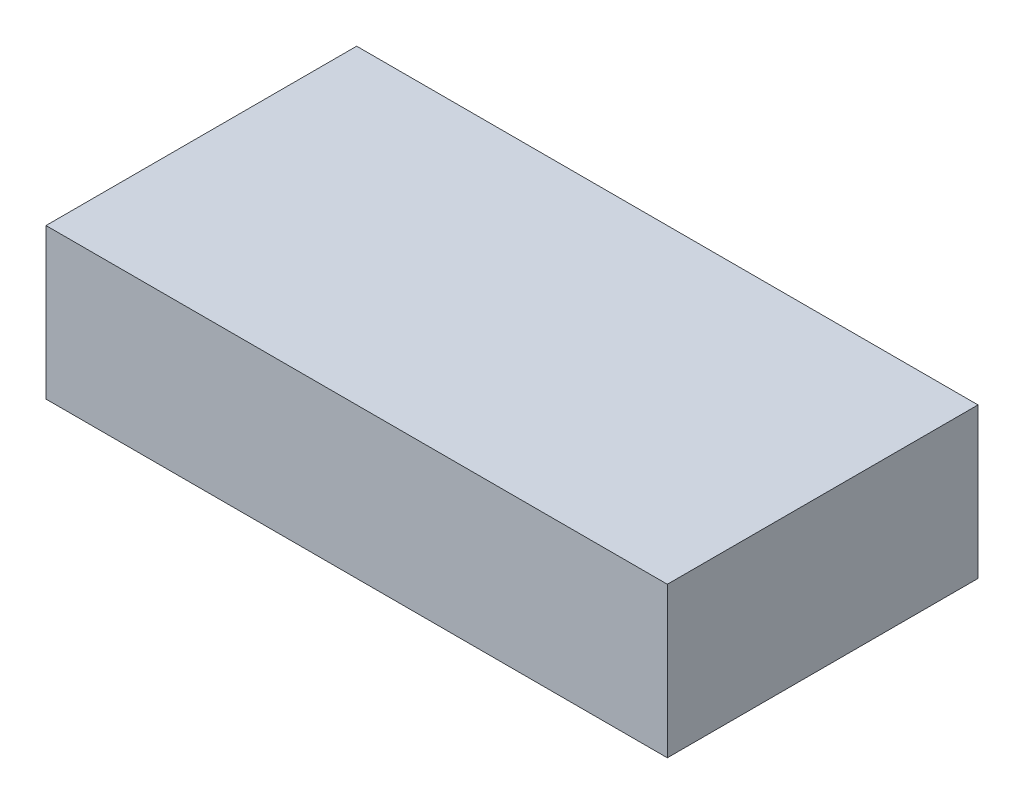
ISO-10303-21;
HEADER;
FILE_DESCRIPTION(('STEP AP214'),'2;1');
FILE_NAME('part.step','',(''),(''),'','','');
FILE_SCHEMA(('AUTOMOTIVE_DESIGN { 1 0 10303 214 1 1 1 1 }'));
ENDSEC;
DATA;
#1=APPLICATION_CONTEXT('core data for automotive mechanical design processes');
#2=APPLICATION_PROTOCOL_DEFINITION('international standard','automotive_design',2000,#1);
#3=PRODUCT_CONTEXT('',#1,'mechanical');
#4=PRODUCT('Part','Part','',(#3));
#5=PRODUCT_RELATED_PRODUCT_CATEGORY('part','',(#4));
#6=PRODUCT_DEFINITION_FORMATION('','',#4);
#7=PRODUCT_DEFINITION_CONTEXT('part definition',#1,'design');
#8=PRODUCT_DEFINITION('design','',#6,#7);
#9=PRODUCT_DEFINITION_SHAPE('','',#8);
#10=(LENGTH_UNIT() NAMED_UNIT(*) SI_UNIT(.MILLI.,.METRE.));
#11=(NAMED_UNIT(*) PLANE_ANGLE_UNIT() SI_UNIT($,.RADIAN.));
#12=(NAMED_UNIT(*) SI_UNIT($,.STERADIAN.) SOLID_ANGLE_UNIT());
#13=UNCERTAINTY_MEASURE_WITH_UNIT(LENGTH_MEASURE(1.E-05),#10,'distance_accuracy_value','');
#14=(GEOMETRIC_REPRESENTATION_CONTEXT(3) GLOBAL_UNCERTAINTY_ASSIGNED_CONTEXT((#13)) GLOBAL_UNIT_ASSIGNED_CONTEXT((#10,
#11,#12)) REPRESENTATION_CONTEXT('',''));
#15=CARTESIAN_POINT('',(0.,0.,0.));
#16=DIRECTION('',(0.,0.,1.));
#17=DIRECTION('',(1.,0.,0.));
#18=AXIS2_PLACEMENT_3D('',#15,#16,#17);
#19=CARTESIAN_POINT('',(-31.,15.,15.5));
#20=DIRECTION('',(1.,0.,0.));
#21=DIRECTION('',(0.,0.,-1.));
#22=AXIS2_PLACEMENT_3D('',#19,#20,#21);
#23=PLANE('',#22);
#24=DIRECTION('',(0.,0.,1.));
#25=VECTOR('',#24,1.);
#26=CARTESIAN_POINT('',(-31.,0.,15.5));
#27=LINE('',#26,#25);
#28=CARTESIAN_POINT('',(-31.,0.,-15.5));
#29=VERTEX_POINT('',#28);
#30=CARTESIAN_POINT('',(-31.,0.,15.5));
#31=VERTEX_POINT('',#30);
#32=EDGE_CURVE('E96',#29,#31,#27,.T.);
#33=ORIENTED_EDGE('',*,*,#32,.T.);
#34=DIRECTION('',(0.,-1.,0.));
#35=VECTOR('',#34,1.);
#36=CARTESIAN_POINT('',(-31.,15.,15.5));
#37=LINE('',#36,#35);
#38=CARTESIAN_POINT('',(-31.,15.,15.5));
#39=VERTEX_POINT('',#38);
#40=EDGE_CURVE('E11',#39,#31,#37,.T.);
#41=ORIENTED_EDGE('',*,*,#40,.F.);
#42=DIRECTION('',(0.,0.,1.));
#43=VECTOR('',#42,1.);
#44=CARTESIAN_POINT('',(-31.,15.,15.5));
#45=LINE('',#44,#43);
#46=CARTESIAN_POINT('',(-31.,15.,-15.5));
#47=VERTEX_POINT('',#46);
#48=EDGE_CURVE('E84',#47,#39,#45,.T.);
#49=ORIENTED_EDGE('',*,*,#48,.F.);
#50=DIRECTION('',(0.,-1.,0.));
#51=VECTOR('',#50,1.);
#52=CARTESIAN_POINT('',(-31.,15.,-15.5));
#53=LINE('',#52,#51);
#54=EDGE_CURVE('E92',#47,#29,#53,.T.);
#55=ORIENTED_EDGE('',*,*,#54,.T.);
#56=EDGE_LOOP('',(#33,#41,#49,#55));
#57=FACE_BOUND('',#56,.T.);
#58=ADVANCED_FACE('F33',(#57),#23,.F.);
#59=CARTESIAN_POINT('',(-31.,15.,15.5));
#60=DIRECTION('',(0.,0.,-1.));
#61=DIRECTION('',(-1.,0.,0.));
#62=AXIS2_PLACEMENT_3D('',#59,#60,#61);
#63=PLANE('',#62);
#64=DIRECTION('',(1.,0.,0.));
#65=VECTOR('',#64,1.);
#66=CARTESIAN_POINT('',(-31.,0.,15.5));
#67=LINE('',#66,#65);
#68=CARTESIAN_POINT('',(31.,0.,15.5));
#69=VERTEX_POINT('',#68);
#70=EDGE_CURVE('E88',#31,#69,#67,.T.);
#71=ORIENTED_EDGE('',*,*,#70,.T.);
#72=DIRECTION('',(0.,-1.,0.));
#73=VECTOR('',#72,1.);
#74=CARTESIAN_POINT('',(31.,15.,15.5));
#75=LINE('',#74,#73);
#76=CARTESIAN_POINT('',(31.,15.,15.5));
#77=VERTEX_POINT('',#76);
#78=EDGE_CURVE('E41',#77,#69,#75,.T.);
#79=ORIENTED_EDGE('',*,*,#78,.F.);
#80=DIRECTION('',(1.,0.,0.));
#81=VECTOR('',#80,1.);
#82=CARTESIAN_POINT('',(-31.,15.,15.5));
#83=LINE('',#82,#81);
#84=EDGE_CURVE('E79',#39,#77,#83,.T.);
#85=ORIENTED_EDGE('',*,*,#84,.F.);
#86=ORIENTED_EDGE('',*,*,#40,.T.);
#87=EDGE_LOOP('',(#71,#79,#85,#86));
#88=FACE_BOUND('',#87,.T.);
#89=ADVANCED_FACE('F87',(#88),#63,.F.);
#90=CARTESIAN_POINT('',(31.,15.,15.5));
#91=DIRECTION('',(-1.,0.,0.));
#92=DIRECTION('',(0.,0.,1.));
#93=AXIS2_PLACEMENT_3D('',#90,#91,#92);
#94=PLANE('',#93);
#95=DIRECTION('',(0.,0.,-1.));
#96=VECTOR('',#95,1.);
#97=CARTESIAN_POINT('',(31.,0.,15.5));
#98=LINE('',#97,#96);
#99=CARTESIAN_POINT('',(31.,0.,-15.5));
#100=VERTEX_POINT('',#99);
#101=EDGE_CURVE('E66',#69,#100,#98,.T.);
#102=ORIENTED_EDGE('',*,*,#101,.T.);
#103=DIRECTION('',(0.,-1.,0.));
#104=VECTOR('',#103,1.);
#105=CARTESIAN_POINT('',(31.,15.,-15.5));
#106=LINE('',#105,#104);
#107=CARTESIAN_POINT('',(31.,15.,-15.5));
#108=VERTEX_POINT('',#107);
#109=EDGE_CURVE('E89',#108,#100,#106,.T.);
#110=ORIENTED_EDGE('',*,*,#109,.F.);
#111=DIRECTION('',(0.,0.,-1.));
#112=VECTOR('',#111,1.);
#113=CARTESIAN_POINT('',(31.,15.,15.5));
#114=LINE('',#113,#112);
#115=EDGE_CURVE('E82',#77,#108,#114,.T.);
#116=ORIENTED_EDGE('',*,*,#115,.F.);
#117=ORIENTED_EDGE('',*,*,#78,.T.);
#118=EDGE_LOOP('',(#102,#110,#116,#117));
#119=FACE_BOUND('',#118,.T.);
#120=ADVANCED_FACE('F90',(#119),#94,.F.);
#121=CARTESIAN_POINT('',(-31.,15.,-15.5));
#122=DIRECTION('',(0.,0.,1.));
#123=DIRECTION('',(1.,0.,0.));
#124=AXIS2_PLACEMENT_3D('',#121,#122,#123);
#125=PLANE('',#124);
#126=DIRECTION('',(-1.,0.,0.));
#127=VECTOR('',#126,1.);
#128=CARTESIAN_POINT('',(-31.,0.,-15.5));
#129=LINE('',#128,#127);
#130=EDGE_CURVE('E72',#100,#29,#129,.T.);
#131=ORIENTED_EDGE('',*,*,#130,.T.);
#132=ORIENTED_EDGE('',*,*,#54,.F.);
#133=DIRECTION('',(-1.,0.,0.));
#134=VECTOR('',#133,1.);
#135=CARTESIAN_POINT('',(-31.,15.,-15.5));
#136=LINE('',#135,#134);
#137=EDGE_CURVE('E49',#108,#47,#136,.T.);
#138=ORIENTED_EDGE('',*,*,#137,.F.);
#139=ORIENTED_EDGE('',*,*,#109,.T.);
#140=EDGE_LOOP('',(#131,#132,#138,#139));
#141=FACE_BOUND('',#140,.T.);
#142=ADVANCED_FACE('F103',(#141),#125,.F.);
#143=CARTESIAN_POINT('',(0.,15.,0.));
#144=DIRECTION('',(0.,-1.,0.));
#145=DIRECTION('',(0.,0.,-1.));
#146=AXIS2_PLACEMENT_3D('',#143,#144,#145);
#147=PLANE('',#146);
#148=ORIENTED_EDGE('',*,*,#48,.T.);
#149=ORIENTED_EDGE('',*,*,#84,.T.);
#150=ORIENTED_EDGE('',*,*,#115,.T.);
#151=ORIENTED_EDGE('',*,*,#137,.T.);
#152=EDGE_LOOP('',(#148,#149,#150,#151));
#153=FACE_BOUND('',#152,.T.);
#154=ADVANCED_FACE('F80',(#153),#147,.F.);
#155=CARTESIAN_POINT('',(0.,0.,0.));
#156=DIRECTION('',(0.,-1.,0.));
#157=DIRECTION('',(0.,0.,-1.));
#158=AXIS2_PLACEMENT_3D('',#155,#156,#157);
#159=PLANE('',#158);
#160=ORIENTED_EDGE('',*,*,#32,.F.);
#161=ORIENTED_EDGE('',*,*,#130,.F.);
#162=ORIENTED_EDGE('',*,*,#101,.F.);
#163=ORIENTED_EDGE('',*,*,#70,.F.);
#164=EDGE_LOOP('',(#160,#161,#162,#163));
#165=FACE_BOUND('',#164,.T.);
#166=ADVANCED_FACE('F106',(#165),#159,.T.);
#167=CLOSED_SHELL('',(#58,#89,#120,#142,#154,#166));
#168=MANIFOLD_SOLID_BREP('B2',#167);
#169=ADVANCED_BREP_SHAPE_REPRESENTATION('',(#18,#168),#14);
#170=SHAPE_DEFINITION_REPRESENTATION(#9,#169);
ENDSEC;
END-ISO-10303-21;
